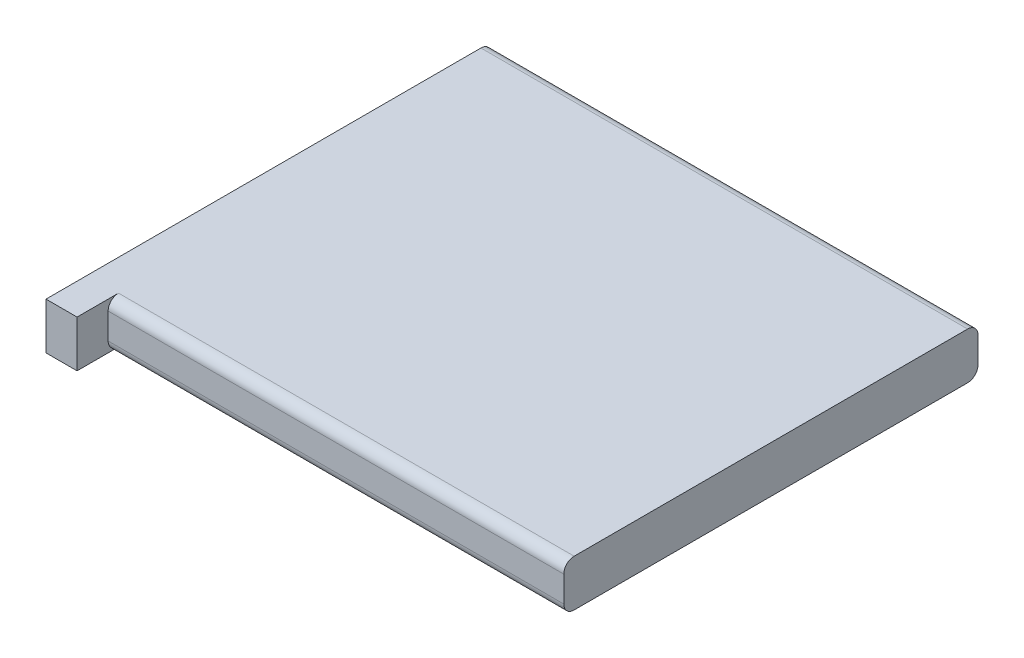
ISO-10303-21;
HEADER;
FILE_DESCRIPTION(('STEP AP214'),'2;1');
FILE_NAME('part.step','',(''),(''),'','','');
FILE_SCHEMA(('AUTOMOTIVE_DESIGN { 1 0 10303 214 1 1 1 1 }'));
ENDSEC;
DATA;
#1=APPLICATION_CONTEXT('core data for automotive mechanical design processes');
#2=APPLICATION_PROTOCOL_DEFINITION('international standard','automotive_design',2000,#1);
#3=PRODUCT_CONTEXT('',#1,'mechanical');
#4=PRODUCT('Part','Part','',(#3));
#5=PRODUCT_RELATED_PRODUCT_CATEGORY('part','',(#4));
#6=PRODUCT_DEFINITION_FORMATION('','',#4);
#7=PRODUCT_DEFINITION_CONTEXT('part definition',#1,'design');
#8=PRODUCT_DEFINITION('design','',#6,#7);
#9=PRODUCT_DEFINITION_SHAPE('','',#8);
#10=(LENGTH_UNIT() NAMED_UNIT(*) SI_UNIT(.MILLI.,.METRE.));
#11=(NAMED_UNIT(*) PLANE_ANGLE_UNIT() SI_UNIT($,.RADIAN.));
#12=(NAMED_UNIT(*) SI_UNIT($,.STERADIAN.) SOLID_ANGLE_UNIT());
#13=UNCERTAINTY_MEASURE_WITH_UNIT(LENGTH_MEASURE(1.E-05),#10,'distance_accuracy_value','');
#14=(GEOMETRIC_REPRESENTATION_CONTEXT(3) GLOBAL_UNCERTAINTY_ASSIGNED_CONTEXT((#13)) GLOBAL_UNIT_ASSIGNED_CONTEXT((#10,
#11,#12)) REPRESENTATION_CONTEXT('',''));
#15=CARTESIAN_POINT('',(0.,0.,0.));
#16=DIRECTION('',(0.,0.,1.));
#17=DIRECTION('',(1.,0.,0.));
#18=AXIS2_PLACEMENT_3D('',#15,#16,#17);
#19=CARTESIAN_POINT('',(-23.5,4.5,20.));
#20=DIRECTION('',(1.,0.,0.));
#21=DIRECTION('',(0.,0.,-1.));
#22=AXIS2_PLACEMENT_3D('',#19,#20,#21);
#23=PLANE('',#22);
#24=DIRECTION('',(0.,-1.,0.));
#25=VECTOR('',#24,1.);
#26=CARTESIAN_POINT('',(-23.5,4.5,23.));
#27=LINE('',#26,#25);
#28=CARTESIAN_POINT('',(-23.5,4.5,23.));
#29=VERTEX_POINT('',#28);
#30=CARTESIAN_POINT('',(-23.5,0.,23.));
#31=VERTEX_POINT('',#30);
#32=EDGE_CURVE('E116',#29,#31,#27,.T.);
#33=ORIENTED_EDGE('',*,*,#32,.F.);
#34=DIRECTION('',(0.,0.,1.));
#35=VECTOR('',#34,1.);
#36=CARTESIAN_POINT('',(-23.5,4.5,20.));
#37=LINE('',#36,#35);
#38=CARTESIAN_POINT('',(-23.5,4.5,-19.));
#39=VERTEX_POINT('',#38);
#40=EDGE_CURVE('E146',#39,#29,#37,.T.);
#41=ORIENTED_EDGE('',*,*,#40,.F.);
#42=CARTESIAN_POINT('',(-23.5,3.5,-19.));
#43=DIRECTION('',(1.,0.,0.));
#44=DIRECTION('',(0.,0.,-1.));
#45=AXIS2_PLACEMENT_3D('',#42,#43,#44);
#46=CIRCLE('',#45,1.);
#47=CARTESIAN_POINT('',(-23.5,3.5,-20.));
#48=VERTEX_POINT('',#47);
#49=EDGE_CURVE('E166',#39,#48,#46,.F.);
#50=ORIENTED_EDGE('',*,*,#49,.T.);
#51=DIRECTION('',(0.,-1.,0.));
#52=VECTOR('',#51,1.);
#53=CARTESIAN_POINT('',(-23.5,4.5,-20.));
#54=LINE('',#53,#52);
#55=CARTESIAN_POINT('',(-23.5,1.,-20.));
#56=VERTEX_POINT('',#55);
#57=EDGE_CURVE('E150',#48,#56,#54,.T.);
#58=ORIENTED_EDGE('',*,*,#57,.T.);
#59=CARTESIAN_POINT('',(-23.5,1.,-19.));
#60=DIRECTION('',(1.,0.,0.));
#61=DIRECTION('',(0.,0.,-1.));
#62=AXIS2_PLACEMENT_3D('',#59,#60,#61);
#63=CIRCLE('',#62,1.);
#64=CARTESIAN_POINT('',(-23.5,0.,-19.));
#65=VERTEX_POINT('',#64);
#66=EDGE_CURVE('E118',#56,#65,#63,.F.);
#67=ORIENTED_EDGE('',*,*,#66,.T.);
#68=DIRECTION('',(0.,0.,1.));
#69=VECTOR('',#68,1.);
#70=CARTESIAN_POINT('',(-23.5,0.,20.));
#71=LINE('',#70,#69);
#72=EDGE_CURVE('E112',#65,#31,#71,.T.);
#73=ORIENTED_EDGE('',*,*,#72,.T.);
#74=EDGE_LOOP('',(#33,#41,#50,#58,#67,#73));
#75=FACE_BOUND('',#74,.T.);
#76=ADVANCED_FACE('F33',(#75),#23,.F.);
#77=CARTESIAN_POINT('',(23.5,4.5,20.));
#78=DIRECTION('',(0.,0.,-1.));
#79=DIRECTION('',(-1.,0.,0.));
#80=AXIS2_PLACEMENT_3D('',#77,#78,#79);
#81=PLANE('',#80);
#82=DIRECTION('',(1.,0.,0.));
#83=VECTOR('',#82,1.);
#84=CARTESIAN_POINT('',(-23.5,3.5,20.));
#85=LINE('',#84,#83);
#86=CARTESIAN_POINT('',(23.5,3.5,20.));
#87=VERTEX_POINT('',#86);
#88=CARTESIAN_POINT('',(-20.5,3.5,20.));
#89=VERTEX_POINT('',#88);
#90=EDGE_CURVE('E186',#87,#89,#85,.F.);
#91=ORIENTED_EDGE('',*,*,#90,.T.);
#92=DIRECTION('',(0.,-1.,0.));
#93=VECTOR('',#92,1.);
#94=CARTESIAN_POINT('',(-20.5,4.49999999999997,20.));
#95=LINE('',#94,#93);
#96=CARTESIAN_POINT('',(-20.5,1.,20.));
#97=VERTEX_POINT('',#96);
#98=EDGE_CURVE('E48',#89,#97,#95,.T.);
#99=ORIENTED_EDGE('',*,*,#98,.T.);
#100=DIRECTION('',(1.,0.,0.));
#101=VECTOR('',#100,1.);
#102=CARTESIAN_POINT('',(23.5,1.,20.));
#103=LINE('',#102,#101);
#104=CARTESIAN_POINT('',(23.5,1.,20.));
#105=VERTEX_POINT('',#104);
#106=EDGE_CURVE('E41',#97,#105,#103,.T.);
#107=ORIENTED_EDGE('',*,*,#106,.T.);
#108=DIRECTION('',(0.,-1.,0.));
#109=VECTOR('',#108,1.);
#110=CARTESIAN_POINT('',(23.5,4.5,20.));
#111=LINE('',#110,#109);
#112=EDGE_CURVE('E158',#87,#105,#111,.T.);
#113=ORIENTED_EDGE('',*,*,#112,.F.);
#114=EDGE_LOOP('',(#91,#99,#107,#113));
#115=FACE_BOUND('',#114,.T.);
#116=ADVANCED_FACE('F189',(#115),#81,.F.);
#117=CARTESIAN_POINT('',(23.5,4.5,20.));
#118=DIRECTION('',(-1.,0.,0.));
#119=DIRECTION('',(0.,0.,1.));
#120=AXIS2_PLACEMENT_3D('',#117,#118,#119);
#121=PLANE('',#120);
#122=DIRECTION('',(0.,0.,-1.));
#123=VECTOR('',#122,1.);
#124=CARTESIAN_POINT('',(23.5,0.,20.));
#125=LINE('',#124,#123);
#126=CARTESIAN_POINT('',(23.5,0.,19.));
#127=VERTEX_POINT('',#126);
#128=CARTESIAN_POINT('',(23.5,0.,-19.));
#129=VERTEX_POINT('',#128);
#130=EDGE_CURVE('E121',#127,#129,#125,.T.);
#131=ORIENTED_EDGE('',*,*,#130,.T.);
#132=CARTESIAN_POINT('',(23.5,1.,-19.));
#133=DIRECTION('',(-1.,0.,0.));
#134=DIRECTION('',(0.,0.,1.));
#135=AXIS2_PLACEMENT_3D('',#132,#133,#134);
#136=CIRCLE('',#135,1.);
#137=CARTESIAN_POINT('',(23.5,1.,-20.));
#138=VERTEX_POINT('',#137);
#139=EDGE_CURVE('E179',#129,#138,#136,.F.);
#140=ORIENTED_EDGE('',*,*,#139,.T.);
#141=DIRECTION('',(0.,-1.,0.));
#142=VECTOR('',#141,1.);
#143=CARTESIAN_POINT('',(23.5,4.5,-20.));
#144=LINE('',#143,#142);
#145=CARTESIAN_POINT('',(23.5,3.5,-20.));
#146=VERTEX_POINT('',#145);
#147=EDGE_CURVE('E155',#146,#138,#144,.T.);
#148=ORIENTED_EDGE('',*,*,#147,.F.);
#149=CARTESIAN_POINT('',(23.5,3.5,-19.));
#150=DIRECTION('',(-1.,0.,0.));
#151=DIRECTION('',(0.,0.,1.));
#152=AXIS2_PLACEMENT_3D('',#149,#150,#151);
#153=CIRCLE('',#152,1.);
#154=CARTESIAN_POINT('',(23.5,4.5,-19.));
#155=VERTEX_POINT('',#154);
#156=EDGE_CURVE('E177',#146,#155,#153,.F.);
#157=ORIENTED_EDGE('',*,*,#156,.T.);
#158=DIRECTION('',(0.,0.,-1.));
#159=VECTOR('',#158,1.);
#160=CARTESIAN_POINT('',(23.5,4.5,20.));
#161=LINE('',#160,#159);
#162=CARTESIAN_POINT('',(23.5,4.5,19.));
#163=VERTEX_POINT('',#162);
#164=EDGE_CURVE('E148',#163,#155,#161,.T.);
#165=ORIENTED_EDGE('',*,*,#164,.F.);
#166=CARTESIAN_POINT('',(23.5,3.5,19.));
#167=DIRECTION('',(-1.,0.,0.));
#168=DIRECTION('',(0.,0.,1.));
#169=AXIS2_PLACEMENT_3D('',#166,#167,#168);
#170=CIRCLE('',#169,1.);
#171=EDGE_CURVE('E173',#163,#87,#170,.F.);
#172=ORIENTED_EDGE('',*,*,#171,.T.);
#173=ORIENTED_EDGE('',*,*,#112,.T.);
#174=CARTESIAN_POINT('',(23.5,1.,19.));
#175=DIRECTION('',(-1.,0.,0.));
#176=DIRECTION('',(0.,0.,1.));
#177=AXIS2_PLACEMENT_3D('',#174,#175,#176);
#178=CIRCLE('',#177,1.);
#179=EDGE_CURVE('E175',#105,#127,#178,.F.);
#180=ORIENTED_EDGE('',*,*,#179,.T.);
#181=EDGE_LOOP('',(#131,#140,#148,#157,#165,#172,#173,#180));
#182=FACE_BOUND('',#181,.T.);
#183=ADVANCED_FACE('F194',(#182),#121,.F.);
#184=CARTESIAN_POINT('',(23.5,4.5,-20.));
#185=DIRECTION('',(0.,0.,1.));
#186=DIRECTION('',(1.,0.,0.));
#187=AXIS2_PLACEMENT_3D('',#184,#185,#186);
#188=PLANE('',#187);
#189=ORIENTED_EDGE('',*,*,#147,.T.);
#190=DIRECTION('',(-1.,0.,0.));
#191=VECTOR('',#190,1.);
#192=CARTESIAN_POINT('',(23.5,1.,-20.));
#193=LINE('',#192,#191);
#194=EDGE_CURVE('E163',#138,#56,#193,.T.);
#195=ORIENTED_EDGE('',*,*,#194,.T.);
#196=ORIENTED_EDGE('',*,*,#57,.F.);
#197=DIRECTION('',(-1.,0.,0.));
#198=VECTOR('',#197,1.);
#199=CARTESIAN_POINT('',(23.5,3.5,-20.));
#200=LINE('',#199,#198);
#201=EDGE_CURVE('E161',#48,#146,#200,.F.);
#202=ORIENTED_EDGE('',*,*,#201,.T.);
#203=EDGE_LOOP('',(#189,#195,#196,#202));
#204=FACE_BOUND('',#203,.T.);
#205=ADVANCED_FACE('F208',(#204),#188,.F.);
#206=CARTESIAN_POINT('',(0.,4.5,0.));
#207=DIRECTION('',(0.,1.,0.));
#208=DIRECTION('',(0.,0.,1.));
#209=AXIS2_PLACEMENT_3D('',#206,#207,#208);
#210=PLANE('',#209);
#211=DIRECTION('',(0.,0.,1.));
#212=VECTOR('',#211,1.);
#213=CARTESIAN_POINT('',(-20.5,4.5,17.));
#214=LINE('',#213,#212);
#215=CARTESIAN_POINT('',(-20.5,4.5,19.));
#216=VERTEX_POINT('',#215);
#217=CARTESIAN_POINT('',(-20.5,4.5,23.));
#218=VERTEX_POINT('',#217);
#219=EDGE_CURVE('E141',#216,#218,#214,.T.);
#220=ORIENTED_EDGE('',*,*,#219,.F.);
#221=DIRECTION('',(1.,0.,0.));
#222=VECTOR('',#221,1.);
#223=CARTESIAN_POINT('',(23.5,4.5,19.));
#224=LINE('',#223,#222);
#225=EDGE_CURVE('E181',#216,#163,#224,.T.);
#226=ORIENTED_EDGE('',*,*,#225,.T.);
#227=ORIENTED_EDGE('',*,*,#164,.T.);
#228=DIRECTION('',(-1.,0.,0.));
#229=VECTOR('',#228,1.);
#230=CARTESIAN_POINT('',(-23.5,4.5,-19.));
#231=LINE('',#230,#229);
#232=EDGE_CURVE('E183',#155,#39,#231,.T.);
#233=ORIENTED_EDGE('',*,*,#232,.T.);
#234=ORIENTED_EDGE('',*,*,#40,.T.);
#235=DIRECTION('',(-1.,0.,0.));
#236=VECTOR('',#235,1.);
#237=CARTESIAN_POINT('',(-23.5,4.5,23.));
#238=LINE('',#237,#236);
#239=EDGE_CURVE('E136',#218,#29,#238,.T.);
#240=ORIENTED_EDGE('',*,*,#239,.F.);
#241=EDGE_LOOP('',(#220,#226,#227,#233,#234,#240));
#242=FACE_BOUND('',#241,.T.);
#243=ADVANCED_FACE('F202',(#242),#210,.T.);
#244=CARTESIAN_POINT('',(0.,0.,0.));
#245=DIRECTION('',(0.,1.,0.));
#246=DIRECTION('',(0.,0.,1.));
#247=AXIS2_PLACEMENT_3D('',#244,#245,#246);
#248=PLANE('',#247);
#249=DIRECTION('',(1.,0.,0.));
#250=VECTOR('',#249,1.);
#251=CARTESIAN_POINT('',(0.,0.,19.));
#252=LINE('',#251,#250);
#253=CARTESIAN_POINT('',(-20.5,0.,19.));
#254=VERTEX_POINT('',#253);
#255=EDGE_CURVE('E169',#127,#254,#252,.F.);
#256=ORIENTED_EDGE('',*,*,#255,.T.);
#257=DIRECTION('',(0.,0.,1.));
#258=VECTOR('',#257,1.);
#259=CARTESIAN_POINT('',(-20.5,0.,17.));
#260=LINE('',#259,#258);
#261=CARTESIAN_POINT('',(-20.5,0.,23.));
#262=VERTEX_POINT('',#261);
#263=EDGE_CURVE('E127',#254,#262,#260,.T.);
#264=ORIENTED_EDGE('',*,*,#263,.T.);
#265=DIRECTION('',(1.,0.,0.));
#266=VECTOR('',#265,1.);
#267=CARTESIAN_POINT('',(-23.5,0.,23.));
#268=LINE('',#267,#266);
#269=EDGE_CURVE('E124',#31,#262,#268,.T.);
#270=ORIENTED_EDGE('',*,*,#269,.F.);
#271=ORIENTED_EDGE('',*,*,#72,.F.);
#272=DIRECTION('',(-1.,0.,0.));
#273=VECTOR('',#272,1.);
#274=CARTESIAN_POINT('',(0.,0.,-19.));
#275=LINE('',#274,#273);
#276=EDGE_CURVE('E171',#65,#129,#275,.F.);
#277=ORIENTED_EDGE('',*,*,#276,.T.);
#278=ORIENTED_EDGE('',*,*,#130,.F.);
#279=EDGE_LOOP('',(#256,#264,#270,#271,#277,#278));
#280=FACE_BOUND('',#279,.T.);
#281=ADVANCED_FACE('F125',(#280),#248,.F.);
#282=CARTESIAN_POINT('',(23.5,1.,-19.));
#283=DIRECTION('',(-1.,0.,0.));
#284=DIRECTION('',(0.,0.,1.));
#285=AXIS2_PLACEMENT_3D('',#282,#283,#284);
#286=CYLINDRICAL_SURFACE('',#285,1.);
#287=ORIENTED_EDGE('',*,*,#139,.F.);
#288=ORIENTED_EDGE('',*,*,#276,.F.);
#289=ORIENTED_EDGE('',*,*,#66,.F.);
#290=ORIENTED_EDGE('',*,*,#194,.F.);
#291=EDGE_LOOP('',(#287,#288,#289,#290));
#292=FACE_BOUND('',#291,.T.);
#293=ADVANCED_FACE('F215',(#292),#286,.T.);
#294=CARTESIAN_POINT('',(0.,3.5,-19.));
#295=DIRECTION('',(1.,0.,0.));
#296=DIRECTION('',(0.,0.,-1.));
#297=AXIS2_PLACEMENT_3D('',#294,#295,#296);
#298=CYLINDRICAL_SURFACE('',#297,1.);
#299=ORIENTED_EDGE('',*,*,#156,.F.);
#300=ORIENTED_EDGE('',*,*,#201,.F.);
#301=ORIENTED_EDGE('',*,*,#49,.F.);
#302=ORIENTED_EDGE('',*,*,#232,.F.);
#303=EDGE_LOOP('',(#299,#300,#301,#302));
#304=FACE_BOUND('',#303,.T.);
#305=ADVANCED_FACE('F212',(#304),#298,.T.);
#306=CARTESIAN_POINT('',(23.5,1.,19.));
#307=DIRECTION('',(1.,0.,0.));
#308=DIRECTION('',(0.,0.,-1.));
#309=AXIS2_PLACEMENT_3D('',#306,#307,#308);
#310=CYLINDRICAL_SURFACE('',#309,1.);
#311=CARTESIAN_POINT('',(-20.5,1.,19.));
#312=DIRECTION('',(1.,0.,0.));
#313=DIRECTION('',(0.,1.,0.));
#314=AXIS2_PLACEMENT_3D('',#311,#312,#313);
#315=CIRCLE('',#314,1.);
#316=EDGE_CURVE('E55',#254,#97,#315,.F.);
#317=ORIENTED_EDGE('',*,*,#316,.F.);
#318=ORIENTED_EDGE('',*,*,#255,.F.);
#319=ORIENTED_EDGE('',*,*,#179,.F.);
#320=ORIENTED_EDGE('',*,*,#106,.F.);
#321=EDGE_LOOP('',(#317,#318,#319,#320));
#322=FACE_BOUND('',#321,.T.);
#323=ADVANCED_FACE('F191',(#322),#310,.T.);
#324=CARTESIAN_POINT('',(0.,3.5,19.));
#325=DIRECTION('',(-1.,0.,0.));
#326=DIRECTION('',(0.,0.,1.));
#327=AXIS2_PLACEMENT_3D('',#324,#325,#326);
#328=CYLINDRICAL_SURFACE('',#327,1.);
#329=CARTESIAN_POINT('',(-20.5,3.5,19.));
#330=DIRECTION('',(1.,0.,0.));
#331=DIRECTION('',(0.,1.,0.));
#332=AXIS2_PLACEMENT_3D('',#329,#330,#331);
#333=CIRCLE('',#332,1.);
#334=EDGE_CURVE('E11',#89,#216,#333,.F.);
#335=ORIENTED_EDGE('',*,*,#334,.F.);
#336=ORIENTED_EDGE('',*,*,#90,.F.);
#337=ORIENTED_EDGE('',*,*,#171,.F.);
#338=ORIENTED_EDGE('',*,*,#225,.F.);
#339=EDGE_LOOP('',(#335,#336,#337,#338));
#340=FACE_BOUND('',#339,.T.);
#341=ADVANCED_FACE('F35',(#340),#328,.T.);
#342=CARTESIAN_POINT('',(-20.5,4.5,17.));
#343=DIRECTION('',(1.,0.,0.));
#344=DIRECTION('',(0.,1.,0.));
#345=AXIS2_PLACEMENT_3D('',#342,#343,#344);
#346=PLANE('',#345);
#347=ORIENTED_EDGE('',*,*,#263,.F.);
#348=ORIENTED_EDGE('',*,*,#316,.T.);
#349=ORIENTED_EDGE('',*,*,#98,.F.);
#350=ORIENTED_EDGE('',*,*,#334,.T.);
#351=ORIENTED_EDGE('',*,*,#219,.T.);
#352=DIRECTION('',(0.,1.,0.));
#353=VECTOR('',#352,1.);
#354=CARTESIAN_POINT('',(-20.5,4.5,23.));
#355=LINE('',#354,#353);
#356=EDGE_CURVE('E131',#262,#218,#355,.T.);
#357=ORIENTED_EDGE('',*,*,#356,.F.);
#358=EDGE_LOOP('',(#347,#348,#349,#350,#351,#357));
#359=FACE_BOUND('',#358,.T.);
#360=ADVANCED_FACE('F199',(#359),#346,.T.);
#361=CARTESIAN_POINT('',(0.,0.,23.));
#362=DIRECTION('',(0.,0.,1.));
#363=DIRECTION('',(1.,0.,0.));
#364=AXIS2_PLACEMENT_3D('',#361,#362,#363);
#365=PLANE('',#364);
#366=ORIENTED_EDGE('',*,*,#32,.T.);
#367=ORIENTED_EDGE('',*,*,#269,.T.);
#368=ORIENTED_EDGE('',*,*,#356,.T.);
#369=ORIENTED_EDGE('',*,*,#239,.T.);
#370=EDGE_LOOP('',(#366,#367,#368,#369));
#371=FACE_BOUND('',#370,.T.);
#372=ADVANCED_FACE('F134',(#371),#365,.T.);
#373=CLOSED_SHELL('',(#76,#116,#183,#205,#243,#281,#293,#305,#323,#341,#360,#372));
#374=MANIFOLD_SOLID_BREP('B2',#373);
#375=ADVANCED_BREP_SHAPE_REPRESENTATION('',(#18,#374),#14);
#376=SHAPE_DEFINITION_REPRESENTATION(#9,#375);
ENDSEC;
END-ISO-10303-21;
